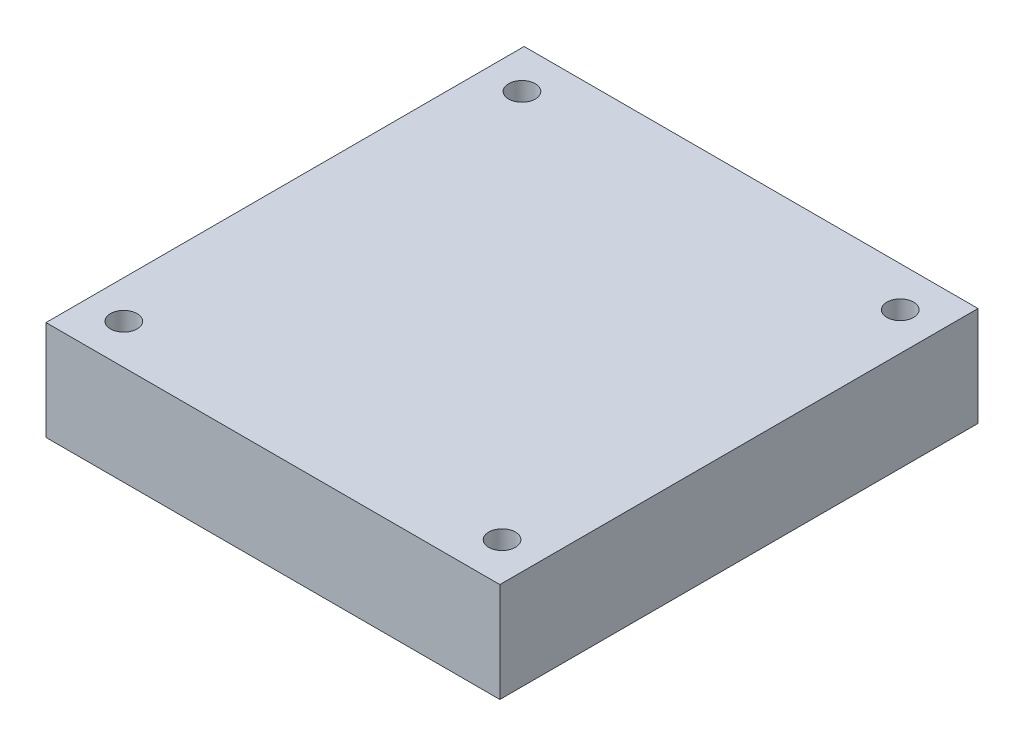
ISO-10303-21;
HEADER;
FILE_DESCRIPTION(('STEP AP214'),'2;1');
FILE_NAME('part.step','',(''),(''),'','','');
FILE_SCHEMA(('AUTOMOTIVE_DESIGN { 1 0 10303 214 1 1 1 1 }'));
ENDSEC;
DATA;
#1=APPLICATION_CONTEXT('core data for automotive mechanical design processes');
#2=APPLICATION_PROTOCOL_DEFINITION('international standard','automotive_design',2000,#1);
#3=PRODUCT_CONTEXT('',#1,'mechanical');
#4=PRODUCT('Part','Part','',(#3));
#5=PRODUCT_RELATED_PRODUCT_CATEGORY('part','',(#4));
#6=PRODUCT_DEFINITION_FORMATION('','',#4);
#7=PRODUCT_DEFINITION_CONTEXT('part definition',#1,'design');
#8=PRODUCT_DEFINITION('design','',#6,#7);
#9=PRODUCT_DEFINITION_SHAPE('','',#8);
#10=(LENGTH_UNIT() NAMED_UNIT(*) SI_UNIT(.MILLI.,.METRE.));
#11=(NAMED_UNIT(*) PLANE_ANGLE_UNIT() SI_UNIT($,.RADIAN.));
#12=(NAMED_UNIT(*) SI_UNIT($,.STERADIAN.) SOLID_ANGLE_UNIT());
#13=UNCERTAINTY_MEASURE_WITH_UNIT(LENGTH_MEASURE(1.E-05),#10,'distance_accuracy_value','');
#14=(GEOMETRIC_REPRESENTATION_CONTEXT(3) GLOBAL_UNCERTAINTY_ASSIGNED_CONTEXT((#13)) GLOBAL_UNIT_ASSIGNED_CONTEXT((#10,
#11,#12)) REPRESENTATION_CONTEXT('',''));
#15=CARTESIAN_POINT('',(0.,0.,0.));
#16=DIRECTION('',(0.,0.,1.));
#17=DIRECTION('',(1.,0.,0.));
#18=AXIS2_PLACEMENT_3D('',#15,#16,#17);
#19=CARTESIAN_POINT('',(-28.95,0.,30.5));
#20=DIRECTION('',(0.,1.,0.));
#21=DIRECTION('',(0.,0.,1.));
#22=AXIS2_PLACEMENT_3D('',#19,#20,#21);
#23=PLANE('',#22);
#24=CARTESIAN_POINT('',(24.13,0.,-25.4));
#25=DIRECTION('',(0.,-1.,0.));
#26=DIRECTION('',(0.,0.,-1.));
#27=AXIS2_PLACEMENT_3D('',#24,#25,#26);
#28=CIRCLE('',#27,1.7);
#29=CARTESIAN_POINT('',(24.13,0.,-27.1));
#30=VERTEX_POINT('',#29);
#31=EDGE_CURVE('E152',#30,#30,#28,.T.);
#32=ORIENTED_EDGE('',*,*,#31,.F.);
#33=EDGE_LOOP('',(#32));
#34=FACE_BOUND('',#33,.T.);
#35=CARTESIAN_POINT('',(-24.13,0.,-25.4));
#36=DIRECTION('',(0.,-1.,0.));
#37=DIRECTION('',(0.,0.,-1.));
#38=AXIS2_PLACEMENT_3D('',#35,#36,#37);
#39=CIRCLE('',#38,1.7);
#40=CARTESIAN_POINT('',(-24.13,0.,-27.1));
#41=VERTEX_POINT('',#40);
#42=EDGE_CURVE('E156',#41,#41,#39,.T.);
#43=ORIENTED_EDGE('',*,*,#42,.F.);
#44=EDGE_LOOP('',(#43));
#45=FACE_BOUND('',#44,.T.);
#46=CARTESIAN_POINT('',(-24.13,0.,25.4));
#47=DIRECTION('',(0.,-1.,0.));
#48=DIRECTION('',(0.,0.,-1.));
#49=AXIS2_PLACEMENT_3D('',#46,#47,#48);
#50=CIRCLE('',#49,1.7);
#51=CARTESIAN_POINT('',(-24.13,0.,23.7));
#52=VERTEX_POINT('',#51);
#53=EDGE_CURVE('E165',#52,#52,#50,.T.);
#54=ORIENTED_EDGE('',*,*,#53,.F.);
#55=EDGE_LOOP('',(#54));
#56=FACE_BOUND('',#55,.T.);
#57=DIRECTION('',(0.,0.,1.));
#58=VECTOR('',#57,1.);
#59=CARTESIAN_POINT('',(-28.95,0.,-30.5));
#60=LINE('',#59,#58);
#61=CARTESIAN_POINT('',(-28.95,0.,-30.5));
#62=VERTEX_POINT('',#61);
#63=CARTESIAN_POINT('',(-28.95,0.,30.5));
#64=VERTEX_POINT('',#63);
#65=EDGE_CURVE('E77',#62,#64,#60,.T.);
#66=ORIENTED_EDGE('',*,*,#65,.F.);
#67=DIRECTION('',(-1.,0.,0.));
#68=VECTOR('',#67,1.);
#69=CARTESIAN_POINT('',(-28.95,0.,-30.5));
#70=LINE('',#69,#68);
#71=CARTESIAN_POINT('',(28.95,0.,-30.5));
#72=VERTEX_POINT('',#71);
#73=EDGE_CURVE('E98',#72,#62,#70,.T.);
#74=ORIENTED_EDGE('',*,*,#73,.F.);
#75=DIRECTION('',(0.,0.,-1.));
#76=VECTOR('',#75,1.);
#77=CARTESIAN_POINT('',(28.95,0.,-30.5));
#78=LINE('',#77,#76);
#79=CARTESIAN_POINT('',(28.95,0.,30.5));
#80=VERTEX_POINT('',#79);
#81=EDGE_CURVE('E78',#80,#72,#78,.T.);
#82=ORIENTED_EDGE('',*,*,#81,.F.);
#83=DIRECTION('',(1.,0.,0.));
#84=VECTOR('',#83,1.);
#85=CARTESIAN_POINT('',(-28.95,0.,30.5));
#86=LINE('',#85,#84);
#87=EDGE_CURVE('E73',#64,#80,#86,.T.);
#88=ORIENTED_EDGE('',*,*,#87,.F.);
#89=EDGE_LOOP('',(#66,#74,#82,#88));
#90=FACE_BOUND('',#89,.T.);
#91=CARTESIAN_POINT('',(24.13,0.,25.4));
#92=DIRECTION('',(0.,-1.,0.));
#93=DIRECTION('',(0.,0.,-1.));
#94=AXIS2_PLACEMENT_3D('',#91,#92,#93);
#95=CIRCLE('',#94,1.7);
#96=CARTESIAN_POINT('',(24.13,0.,23.7));
#97=VERTEX_POINT('',#96);
#98=EDGE_CURVE('E90',#97,#97,#95,.T.);
#99=ORIENTED_EDGE('',*,*,#98,.F.);
#100=EDGE_LOOP('',(#99));
#101=FACE_BOUND('',#100,.T.);
#102=ADVANCED_FACE('F32',(#34,#45,#56,#90,#101),#23,.F.);
#103=CARTESIAN_POINT('',(-28.95,12.7,-30.5));
#104=DIRECTION('',(1.,0.,0.));
#105=DIRECTION('',(0.,0.,-1.));
#106=AXIS2_PLACEMENT_3D('',#103,#104,#105);
#107=PLANE('',#106);
#108=ORIENTED_EDGE('',*,*,#65,.T.);
#109=DIRECTION('',(0.,-1.,0.));
#110=VECTOR('',#109,1.);
#111=CARTESIAN_POINT('',(-28.95,12.7,30.5));
#112=LINE('',#111,#110);
#113=CARTESIAN_POINT('',(-28.95,12.7,30.5));
#114=VERTEX_POINT('',#113);
#115=EDGE_CURVE('E11',#114,#64,#112,.T.);
#116=ORIENTED_EDGE('',*,*,#115,.F.);
#117=DIRECTION('',(0.,0.,1.));
#118=VECTOR('',#117,1.);
#119=CARTESIAN_POINT('',(-28.95,12.7,-30.5));
#120=LINE('',#119,#118);
#121=CARTESIAN_POINT('',(-28.95,12.7,-30.5));
#122=VERTEX_POINT('',#121);
#123=EDGE_CURVE('E100',#122,#114,#120,.T.);
#124=ORIENTED_EDGE('',*,*,#123,.F.);
#125=DIRECTION('',(0.,-1.,0.));
#126=VECTOR('',#125,1.);
#127=CARTESIAN_POINT('',(-28.95,12.7,-30.5));
#128=LINE('',#127,#126);
#129=EDGE_CURVE('E89',#122,#62,#128,.T.);
#130=ORIENTED_EDGE('',*,*,#129,.T.);
#131=EDGE_LOOP('',(#108,#116,#124,#130));
#132=FACE_BOUND('',#131,.T.);
#133=ADVANCED_FACE('F34',(#132),#107,.F.);
#134=CARTESIAN_POINT('',(-28.95,12.7,30.5));
#135=DIRECTION('',(0.,0.,-1.));
#136=DIRECTION('',(-1.,0.,0.));
#137=AXIS2_PLACEMENT_3D('',#134,#135,#136);
#138=PLANE('',#137);
#139=ORIENTED_EDGE('',*,*,#87,.T.);
#140=DIRECTION('',(0.,-1.,0.));
#141=VECTOR('',#140,1.);
#142=CARTESIAN_POINT('',(28.95,12.7,30.5));
#143=LINE('',#142,#141);
#144=CARTESIAN_POINT('',(28.95,12.7,30.5));
#145=VERTEX_POINT('',#144);
#146=EDGE_CURVE('E40',#145,#80,#143,.T.);
#147=ORIENTED_EDGE('',*,*,#146,.F.);
#148=DIRECTION('',(1.,0.,0.));
#149=VECTOR('',#148,1.);
#150=CARTESIAN_POINT('',(-28.95,12.7,30.5));
#151=LINE('',#150,#149);
#152=EDGE_CURVE('E85',#114,#145,#151,.T.);
#153=ORIENTED_EDGE('',*,*,#152,.F.);
#154=ORIENTED_EDGE('',*,*,#115,.T.);
#155=EDGE_LOOP('',(#139,#147,#153,#154));
#156=FACE_BOUND('',#155,.T.);
#157=ADVANCED_FACE('F84',(#156),#138,.F.);
#158=CARTESIAN_POINT('',(28.95,12.7,-30.5));
#159=DIRECTION('',(-1.,0.,0.));
#160=DIRECTION('',(0.,0.,1.));
#161=AXIS2_PLACEMENT_3D('',#158,#159,#160);
#162=PLANE('',#161);
#163=ORIENTED_EDGE('',*,*,#81,.T.);
#164=DIRECTION('',(0.,-1.,0.));
#165=VECTOR('',#164,1.);
#166=CARTESIAN_POINT('',(28.95,12.7,-30.5));
#167=LINE('',#166,#165);
#168=CARTESIAN_POINT('',(28.95,12.7,-30.5));
#169=VERTEX_POINT('',#168);
#170=EDGE_CURVE('E106',#169,#72,#167,.T.);
#171=ORIENTED_EDGE('',*,*,#170,.F.);
#172=DIRECTION('',(0.,0.,-1.));
#173=VECTOR('',#172,1.);
#174=CARTESIAN_POINT('',(28.95,12.7,-30.5));
#175=LINE('',#174,#173);
#176=EDGE_CURVE('E52',#145,#169,#175,.T.);
#177=ORIENTED_EDGE('',*,*,#176,.F.);
#178=ORIENTED_EDGE('',*,*,#146,.T.);
#179=EDGE_LOOP('',(#163,#171,#177,#178));
#180=FACE_BOUND('',#179,.T.);
#181=ADVANCED_FACE('F109',(#180),#162,.F.);
#182=CARTESIAN_POINT('',(-28.95,12.7,-30.5));
#183=DIRECTION('',(0.,0.,1.));
#184=DIRECTION('',(1.,0.,0.));
#185=AXIS2_PLACEMENT_3D('',#182,#183,#184);
#186=PLANE('',#185);
#187=ORIENTED_EDGE('',*,*,#73,.T.);
#188=ORIENTED_EDGE('',*,*,#129,.F.);
#189=DIRECTION('',(-1.,0.,0.));
#190=VECTOR('',#189,1.);
#191=CARTESIAN_POINT('',(-28.95,12.7,-30.5));
#192=LINE('',#191,#190);
#193=EDGE_CURVE('E47',#169,#122,#192,.T.);
#194=ORIENTED_EDGE('',*,*,#193,.F.);
#195=ORIENTED_EDGE('',*,*,#170,.T.);
#196=EDGE_LOOP('',(#187,#188,#194,#195));
#197=FACE_BOUND('',#196,.T.);
#198=ADVANCED_FACE('F111',(#197),#186,.F.);
#199=CARTESIAN_POINT('',(-28.95,12.7,30.5));
#200=DIRECTION('',(0.,1.,0.));
#201=DIRECTION('',(0.,0.,1.));
#202=AXIS2_PLACEMENT_3D('',#199,#200,#201);
#203=PLANE('',#202);
#204=CARTESIAN_POINT('',(24.13,12.7,-25.4));
#205=DIRECTION('',(0.,-1.,0.));
#206=DIRECTION('',(0.,0.,-1.));
#207=AXIS2_PLACEMENT_3D('',#204,#205,#206);
#208=CIRCLE('',#207,1.7);
#209=CARTESIAN_POINT('',(24.13,12.7,-27.1));
#210=VERTEX_POINT('',#209);
#211=EDGE_CURVE('E150',#210,#210,#208,.T.);
#212=ORIENTED_EDGE('',*,*,#211,.T.);
#213=EDGE_LOOP('',(#212));
#214=FACE_BOUND('',#213,.T.);
#215=CARTESIAN_POINT('',(-24.13,12.7,-25.4));
#216=DIRECTION('',(0.,-1.,0.));
#217=DIRECTION('',(0.,0.,-1.));
#218=AXIS2_PLACEMENT_3D('',#215,#216,#217);
#219=CIRCLE('',#218,1.7);
#220=CARTESIAN_POINT('',(-24.13,12.7,-27.1));
#221=VERTEX_POINT('',#220);
#222=EDGE_CURVE('E153',#221,#221,#219,.T.);
#223=ORIENTED_EDGE('',*,*,#222,.T.);
#224=EDGE_LOOP('',(#223));
#225=FACE_BOUND('',#224,.T.);
#226=CARTESIAN_POINT('',(-24.13,12.7,25.4));
#227=DIRECTION('',(0.,-1.,0.));
#228=DIRECTION('',(0.,0.,-1.));
#229=AXIS2_PLACEMENT_3D('',#226,#227,#228);
#230=CIRCLE('',#229,1.7);
#231=CARTESIAN_POINT('',(-24.13,12.7,23.7));
#232=VERTEX_POINT('',#231);
#233=EDGE_CURVE('E162',#232,#232,#230,.T.);
#234=ORIENTED_EDGE('',*,*,#233,.T.);
#235=EDGE_LOOP('',(#234));
#236=FACE_BOUND('',#235,.T.);
#237=CARTESIAN_POINT('',(24.13,12.7,25.4));
#238=DIRECTION('',(0.,-1.,0.));
#239=DIRECTION('',(0.,0.,-1.));
#240=AXIS2_PLACEMENT_3D('',#237,#238,#239);
#241=CIRCLE('',#240,1.7);
#242=CARTESIAN_POINT('',(24.13,12.7,23.7));
#243=VERTEX_POINT('',#242);
#244=EDGE_CURVE('E93',#243,#243,#241,.T.);
#245=ORIENTED_EDGE('',*,*,#244,.T.);
#246=EDGE_LOOP('',(#245));
#247=FACE_BOUND('',#246,.T.);
#248=ORIENTED_EDGE('',*,*,#123,.T.);
#249=ORIENTED_EDGE('',*,*,#152,.T.);
#250=ORIENTED_EDGE('',*,*,#176,.T.);
#251=ORIENTED_EDGE('',*,*,#193,.T.);
#252=EDGE_LOOP('',(#248,#249,#250,#251));
#253=FACE_BOUND('',#252,.T.);
#254=ADVANCED_FACE('F112',(#214,#225,#236,#247,#253),#203,.T.);
#255=CARTESIAN_POINT('',(24.13,0.,25.4));
#256=DIRECTION('',(0.,-1.,0.));
#257=DIRECTION('',(0.,0.,-1.));
#258=AXIS2_PLACEMENT_3D('',#255,#256,#257);
#259=CYLINDRICAL_SURFACE('',#258,1.7);
#260=ORIENTED_EDGE('',*,*,#244,.F.);
#261=EDGE_LOOP('',(#260));
#262=FACE_BOUND('',#261,.T.);
#263=ORIENTED_EDGE('',*,*,#98,.T.);
#264=EDGE_LOOP('',(#263));
#265=FACE_BOUND('',#264,.T.);
#266=ADVANCED_FACE('F114',(#262,#265),#259,.F.);
#267=CARTESIAN_POINT('',(-24.13,0.,25.4));
#268=DIRECTION('',(0.,-1.,0.));
#269=DIRECTION('',(0.,0.,-1.));
#270=AXIS2_PLACEMENT_3D('',#267,#268,#269);
#271=CYLINDRICAL_SURFACE('',#270,1.7);
#272=ORIENTED_EDGE('',*,*,#233,.F.);
#273=EDGE_LOOP('',(#272));
#274=FACE_BOUND('',#273,.T.);
#275=ORIENTED_EDGE('',*,*,#53,.T.);
#276=EDGE_LOOP('',(#275));
#277=FACE_BOUND('',#276,.T.);
#278=ADVANCED_FACE('F121',(#274,#277),#271,.F.);
#279=CARTESIAN_POINT('',(-24.13,0.,-25.4));
#280=DIRECTION('',(0.,-1.,0.));
#281=DIRECTION('',(0.,0.,-1.));
#282=AXIS2_PLACEMENT_3D('',#279,#280,#281);
#283=CYLINDRICAL_SURFACE('',#282,1.7);
#284=ORIENTED_EDGE('',*,*,#222,.F.);
#285=EDGE_LOOP('',(#284));
#286=FACE_BOUND('',#285,.T.);
#287=ORIENTED_EDGE('',*,*,#42,.T.);
#288=EDGE_LOOP('',(#287));
#289=FACE_BOUND('',#288,.T.);
#290=ADVANCED_FACE('F138',(#286,#289),#283,.F.);
#291=CARTESIAN_POINT('',(24.13,0.,-25.4));
#292=DIRECTION('',(0.,-1.,0.));
#293=DIRECTION('',(0.,0.,-1.));
#294=AXIS2_PLACEMENT_3D('',#291,#292,#293);
#295=CYLINDRICAL_SURFACE('',#294,1.7);
#296=ORIENTED_EDGE('',*,*,#211,.F.);
#297=EDGE_LOOP('',(#296));
#298=FACE_BOUND('',#297,.T.);
#299=ORIENTED_EDGE('',*,*,#31,.T.);
#300=EDGE_LOOP('',(#299));
#301=FACE_BOUND('',#300,.T.);
#302=ADVANCED_FACE('F142',(#298,#301),#295,.F.);
#303=CLOSED_SHELL('',(#102,#133,#157,#181,#198,#254,#266,#278,#290,#302));
#304=MANIFOLD_SOLID_BREP('B2',#303);
#305=ADVANCED_BREP_SHAPE_REPRESENTATION('',(#18,#304),#14);
#306=SHAPE_DEFINITION_REPRESENTATION(#9,#305);
ENDSEC;
END-ISO-10303-21;
